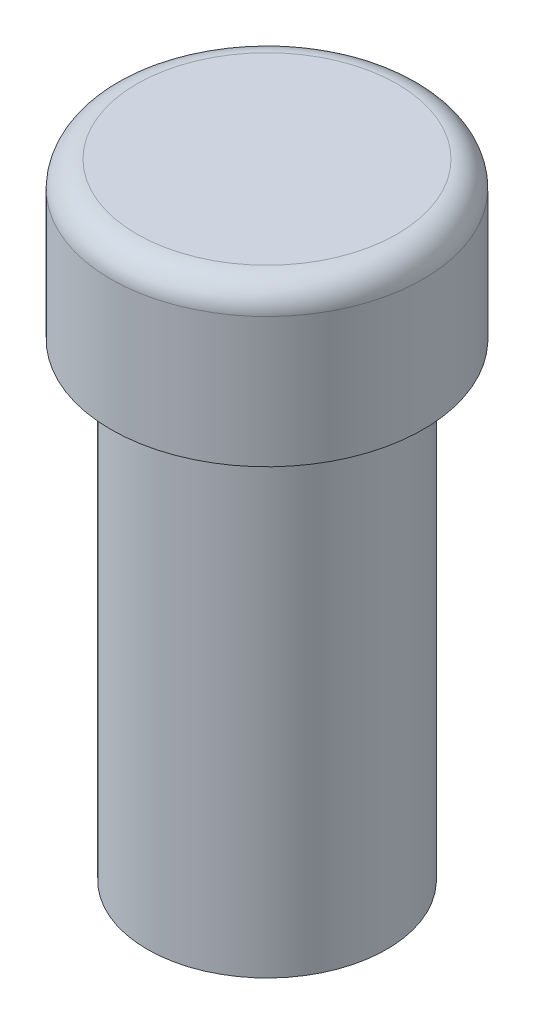
ISO-10303-21;
HEADER;
FILE_DESCRIPTION(('STEP AP214'),'2;1');
FILE_NAME('part.step','',(''),(''),'','','');
FILE_SCHEMA(('AUTOMOTIVE_DESIGN { 1 0 10303 214 1 1 1 1 }'));
ENDSEC;
DATA;
#1=APPLICATION_CONTEXT('core data for automotive mechanical design processes');
#2=APPLICATION_PROTOCOL_DEFINITION('international standard','automotive_design',2000,#1);
#3=PRODUCT_CONTEXT('',#1,'mechanical');
#4=PRODUCT('Part','Part','',(#3));
#5=PRODUCT_RELATED_PRODUCT_CATEGORY('part','',(#4));
#6=PRODUCT_DEFINITION_FORMATION('','',#4);
#7=PRODUCT_DEFINITION_CONTEXT('part definition',#1,'design');
#8=PRODUCT_DEFINITION('design','',#6,#7);
#9=PRODUCT_DEFINITION_SHAPE('','',#8);
#10=(LENGTH_UNIT() NAMED_UNIT(*) SI_UNIT(.MILLI.,.METRE.));
#11=(NAMED_UNIT(*) PLANE_ANGLE_UNIT() SI_UNIT($,.RADIAN.));
#12=(NAMED_UNIT(*) SI_UNIT($,.STERADIAN.) SOLID_ANGLE_UNIT());
#13=UNCERTAINTY_MEASURE_WITH_UNIT(LENGTH_MEASURE(1.E-05),#10,'distance_accuracy_value','');
#14=(GEOMETRIC_REPRESENTATION_CONTEXT(3) GLOBAL_UNCERTAINTY_ASSIGNED_CONTEXT((#13)) GLOBAL_UNIT_ASSIGNED_CONTEXT((#10,
#11,#12)) REPRESENTATION_CONTEXT('',''));
#15=CARTESIAN_POINT('',(0.,0.,0.));
#16=DIRECTION('',(0.,0.,1.));
#17=DIRECTION('',(1.,0.,0.));
#18=AXIS2_PLACEMENT_3D('',#15,#16,#17);
#19=CARTESIAN_POINT('',(0.,3.,0.));
#20=DIRECTION('',(0.,-1.,0.));
#21=DIRECTION('',(0.,0.,-1.));
#22=AXIS2_PLACEMENT_3D('',#19,#20,#21);
#23=CYLINDRICAL_SURFACE('',#22,3.);
#24=CARTESIAN_POINT('',(0.,2.5,0.));
#25=DIRECTION('',(0.,1.,0.));
#26=DIRECTION('',(0.,0.,1.));
#27=AXIS2_PLACEMENT_3D('',#24,#25,#26);
#28=CIRCLE('',#27,3.);
#29=CARTESIAN_POINT('',(0.,2.5,3.));
#30=VERTEX_POINT('',#29);
#31=EDGE_CURVE('E38',#30,#30,#28,.F.);
#32=ORIENTED_EDGE('',*,*,#31,.T.);
#33=EDGE_LOOP('',(#32));
#34=FACE_BOUND('',#33,.T.);
#35=CARTESIAN_POINT('',(0.,0.,0.));
#36=DIRECTION('',(0.,1.,0.));
#37=DIRECTION('',(0.,0.,1.));
#38=AXIS2_PLACEMENT_3D('',#35,#36,#37);
#39=CIRCLE('',#38,3.);
#40=CARTESIAN_POINT('',(0.,0.,3.));
#41=VERTEX_POINT('',#40);
#42=EDGE_CURVE('E50',#41,#41,#39,.T.);
#43=ORIENTED_EDGE('',*,*,#42,.T.);
#44=EDGE_LOOP('',(#43));
#45=FACE_BOUND('',#44,.T.);
#46=ADVANCED_FACE('F34',(#34,#45),#23,.T.);
#47=CARTESIAN_POINT('',(0.,3.,0.));
#48=DIRECTION('',(0.,1.,0.));
#49=DIRECTION('',(0.,0.,1.));
#50=AXIS2_PLACEMENT_3D('',#47,#48,#49);
#51=PLANE('',#50);
#52=CARTESIAN_POINT('',(0.,3.,0.));
#53=DIRECTION('',(0.,1.,0.));
#54=DIRECTION('',(0.,0.,1.));
#55=AXIS2_PLACEMENT_3D('',#52,#53,#54);
#56=CIRCLE('',#55,2.5);
#57=CARTESIAN_POINT('',(0.,3.,2.5));
#58=VERTEX_POINT('',#57);
#59=EDGE_CURVE('E46',#58,#58,#56,.T.);
#60=ORIENTED_EDGE('',*,*,#59,.T.);
#61=EDGE_LOOP('',(#60));
#62=FACE_BOUND('',#61,.T.);
#63=ADVANCED_FACE('F55',(#62),#51,.T.);
#64=CARTESIAN_POINT('',(0.,0.,0.));
#65=DIRECTION('',(0.,1.,0.));
#66=DIRECTION('',(0.,0.,1.));
#67=AXIS2_PLACEMENT_3D('',#64,#65,#66);
#68=PLANE('',#67);
#69=CARTESIAN_POINT('',(0.,0.,0.));
#70=DIRECTION('',(0.,-1.,0.));
#71=DIRECTION('',(0.,0.,-1.));
#72=AXIS2_PLACEMENT_3D('',#69,#70,#71);
#73=CIRCLE('',#72,2.3);
#74=CARTESIAN_POINT('',(0.,0.,-2.3));
#75=VERTEX_POINT('',#74);
#76=EDGE_CURVE('E10',#75,#75,#73,.T.);
#77=ORIENTED_EDGE('',*,*,#76,.F.);
#78=EDGE_LOOP('',(#77));
#79=FACE_BOUND('',#78,.T.);
#80=ORIENTED_EDGE('',*,*,#42,.F.);
#81=EDGE_LOOP('',(#80));
#82=FACE_BOUND('',#81,.T.);
#83=ADVANCED_FACE('F59',(#79,#82),#68,.F.);
#84=CARTESIAN_POINT('',(0.,2.5,0.));
#85=DIRECTION('',(0.,1.,0.));
#86=DIRECTION('',(0.,0.,1.));
#87=AXIS2_PLACEMENT_3D('',#84,#85,#86);
#88=TOROIDAL_SURFACE('',#87,2.5,0.5);
#89=ORIENTED_EDGE('',*,*,#31,.F.);
#90=EDGE_LOOP('',(#89));
#91=FACE_BOUND('',#90,.T.);
#92=ORIENTED_EDGE('',*,*,#59,.F.);
#93=EDGE_LOOP('',(#92));
#94=FACE_BOUND('',#93,.T.);
#95=ADVANCED_FACE('F36',(#91,#94),#88,.T.);
#96=CARTESIAN_POINT('',(0.,-9.,0.));
#97=DIRECTION('',(0.,1.,0.));
#98=DIRECTION('',(0.,0.,1.));
#99=AXIS2_PLACEMENT_3D('',#96,#97,#98);
#100=CYLINDRICAL_SURFACE('',#99,2.3);
#101=CARTESIAN_POINT('',(0.,-9.,0.));
#102=DIRECTION('',(0.,-1.,0.));
#103=DIRECTION('',(0.,0.,-1.));
#104=AXIS2_PLACEMENT_3D('',#101,#102,#103);
#105=CIRCLE('',#104,2.3);
#106=CARTESIAN_POINT('',(0.,-9.,-2.3));
#107=VERTEX_POINT('',#106);
#108=EDGE_CURVE('E49',#107,#107,#105,.T.);
#109=ORIENTED_EDGE('',*,*,#108,.F.);
#110=EDGE_LOOP('',(#109));
#111=FACE_BOUND('',#110,.T.);
#112=ORIENTED_EDGE('',*,*,#76,.T.);
#113=EDGE_LOOP('',(#112));
#114=FACE_BOUND('',#113,.T.);
#115=ADVANCED_FACE('F58',(#111,#114),#100,.T.);
#116=CARTESIAN_POINT('',(0.,-9.,0.));
#117=DIRECTION('',(0.,-1.,0.));
#118=DIRECTION('',(0.,0.,-1.));
#119=AXIS2_PLACEMENT_3D('',#116,#117,#118);
#120=PLANE('',#119);
#121=ORIENTED_EDGE('',*,*,#108,.T.);
#122=EDGE_LOOP('',(#121));
#123=FACE_BOUND('',#122,.T.);
#124=ADVANCED_FACE('F65',(#123),#120,.T.);
#125=CLOSED_SHELL('',(#46,#63,#83,#95,#115,#124));
#126=MANIFOLD_SOLID_BREP('B2',#125);
#127=ADVANCED_BREP_SHAPE_REPRESENTATION('',(#18,#126),#14);
#128=SHAPE_DEFINITION_REPRESENTATION(#9,#127);
ENDSEC;
END-ISO-10303-21;
